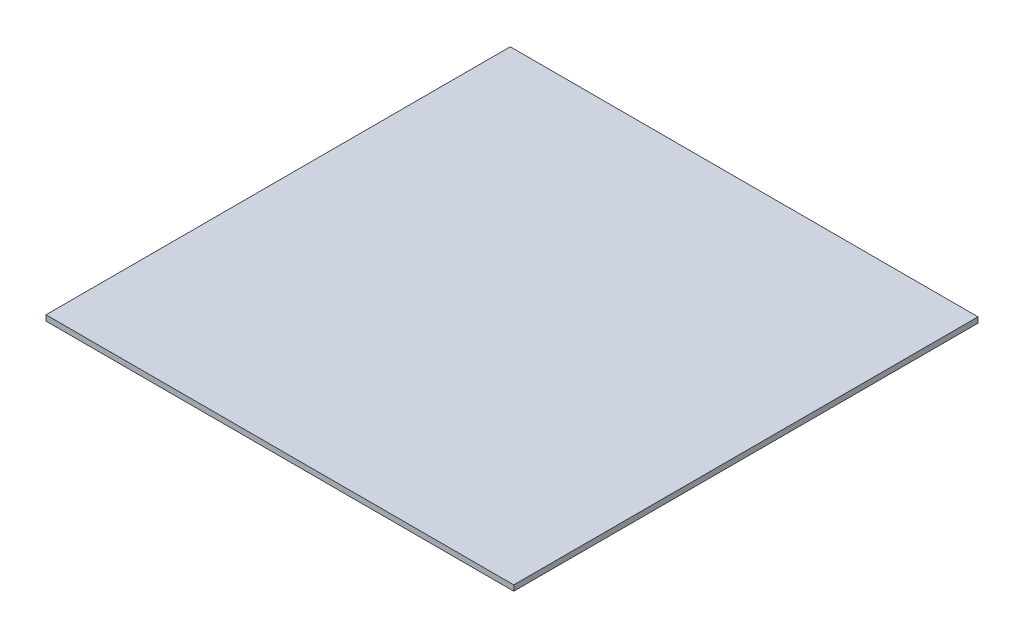
ISO-10303-21;
HEADER;
FILE_DESCRIPTION(('STEP AP214'),'2;1');
FILE_NAME('part.step','',(''),(''),'','','');
FILE_SCHEMA(('AUTOMOTIVE_DESIGN { 1 0 10303 214 1 1 1 1 }'));
ENDSEC;
DATA;
#1=APPLICATION_CONTEXT('core data for automotive mechanical design processes');
#2=APPLICATION_PROTOCOL_DEFINITION('international standard','automotive_design',2000,#1);
#3=PRODUCT_CONTEXT('',#1,'mechanical');
#4=PRODUCT('Part','Part','',(#3));
#5=PRODUCT_RELATED_PRODUCT_CATEGORY('part','',(#4));
#6=PRODUCT_DEFINITION_FORMATION('','',#4);
#7=PRODUCT_DEFINITION_CONTEXT('part definition',#1,'design');
#8=PRODUCT_DEFINITION('design','',#6,#7);
#9=PRODUCT_DEFINITION_SHAPE('','',#8);
#10=(LENGTH_UNIT() NAMED_UNIT(*) SI_UNIT(.MILLI.,.METRE.));
#11=(NAMED_UNIT(*) PLANE_ANGLE_UNIT() SI_UNIT($,.RADIAN.));
#12=(NAMED_UNIT(*) SI_UNIT($,.STERADIAN.) SOLID_ANGLE_UNIT());
#13=UNCERTAINTY_MEASURE_WITH_UNIT(LENGTH_MEASURE(1.E-05),#10,'distance_accuracy_value','');
#14=(GEOMETRIC_REPRESENTATION_CONTEXT(3) GLOBAL_UNCERTAINTY_ASSIGNED_CONTEXT((#13)) GLOBAL_UNIT_ASSIGNED_CONTEXT((#10,
#11,#12)) REPRESENTATION_CONTEXT('',''));
#15=CARTESIAN_POINT('',(0.,0.,0.));
#16=DIRECTION('',(0.,0.,1.));
#17=DIRECTION('',(1.,0.,0.));
#18=AXIS2_PLACEMENT_3D('',#15,#16,#17);
#19=CARTESIAN_POINT('',(0.,1.5875,0.));
#20=DIRECTION('',(1.,0.,0.));
#21=DIRECTION('',(0.,0.,-1.));
#22=AXIS2_PLACEMENT_3D('',#19,#20,#21);
#23=PLANE('',#22);
#24=DIRECTION('',(0.,0.,1.));
#25=VECTOR('',#24,1.);
#26=CARTESIAN_POINT('',(0.,0.,0.));
#27=LINE('',#26,#25);
#28=CARTESIAN_POINT('',(0.,0.,-133.35));
#29=VERTEX_POINT('',#28);
#30=CARTESIAN_POINT('',(0.,0.,0.));
#31=VERTEX_POINT('',#30);
#32=EDGE_CURVE('E96',#29,#31,#27,.T.);
#33=ORIENTED_EDGE('',*,*,#32,.T.);
#34=DIRECTION('',(0.,-1.,0.));
#35=VECTOR('',#34,1.);
#36=CARTESIAN_POINT('',(0.,1.5875,0.));
#37=LINE('',#36,#35);
#38=CARTESIAN_POINT('',(0.,1.5875,0.));
#39=VERTEX_POINT('',#38);
#40=EDGE_CURVE('E11',#39,#31,#37,.T.);
#41=ORIENTED_EDGE('',*,*,#40,.F.);
#42=DIRECTION('',(0.,0.,1.));
#43=VECTOR('',#42,1.);
#44=CARTESIAN_POINT('',(0.,1.5875,0.));
#45=LINE('',#44,#43);
#46=CARTESIAN_POINT('',(0.,1.5875,-133.35));
#47=VERTEX_POINT('',#46);
#48=EDGE_CURVE('E84',#47,#39,#45,.T.);
#49=ORIENTED_EDGE('',*,*,#48,.F.);
#50=DIRECTION('',(0.,-1.,0.));
#51=VECTOR('',#50,1.);
#52=CARTESIAN_POINT('',(0.,1.5875,-133.35));
#53=LINE('',#52,#51);
#54=EDGE_CURVE('E92',#47,#29,#53,.T.);
#55=ORIENTED_EDGE('',*,*,#54,.T.);
#56=EDGE_LOOP('',(#33,#41,#49,#55));
#57=FACE_BOUND('',#56,.T.);
#58=ADVANCED_FACE('F33',(#57),#23,.F.);
#59=CARTESIAN_POINT('',(0.,1.5875,0.));
#60=DIRECTION('',(0.,0.,-1.));
#61=DIRECTION('',(-1.,0.,0.));
#62=AXIS2_PLACEMENT_3D('',#59,#60,#61);
#63=PLANE('',#62);
#64=DIRECTION('',(1.,0.,0.));
#65=VECTOR('',#64,1.);
#66=CARTESIAN_POINT('',(0.,0.,0.));
#67=LINE('',#66,#65);
#68=CARTESIAN_POINT('',(134.366,0.,0.));
#69=VERTEX_POINT('',#68);
#70=EDGE_CURVE('E88',#31,#69,#67,.T.);
#71=ORIENTED_EDGE('',*,*,#70,.T.);
#72=DIRECTION('',(0.,-1.,0.));
#73=VECTOR('',#72,1.);
#74=CARTESIAN_POINT('',(134.366,1.5875,0.));
#75=LINE('',#74,#73);
#76=CARTESIAN_POINT('',(134.366,1.5875,0.));
#77=VERTEX_POINT('',#76);
#78=EDGE_CURVE('E41',#77,#69,#75,.T.);
#79=ORIENTED_EDGE('',*,*,#78,.F.);
#80=DIRECTION('',(1.,0.,0.));
#81=VECTOR('',#80,1.);
#82=CARTESIAN_POINT('',(0.,1.5875,0.));
#83=LINE('',#82,#81);
#84=EDGE_CURVE('E79',#39,#77,#83,.T.);
#85=ORIENTED_EDGE('',*,*,#84,.F.);
#86=ORIENTED_EDGE('',*,*,#40,.T.);
#87=EDGE_LOOP('',(#71,#79,#85,#86));
#88=FACE_BOUND('',#87,.T.);
#89=ADVANCED_FACE('F87',(#88),#63,.F.);
#90=CARTESIAN_POINT('',(134.366,1.5875,0.));
#91=DIRECTION('',(-1.,0.,0.));
#92=DIRECTION('',(0.,0.,1.));
#93=AXIS2_PLACEMENT_3D('',#90,#91,#92);
#94=PLANE('',#93);
#95=DIRECTION('',(0.,0.,-1.));
#96=VECTOR('',#95,1.);
#97=CARTESIAN_POINT('',(134.366,0.,0.));
#98=LINE('',#97,#96);
#99=CARTESIAN_POINT('',(134.366,0.,-133.35));
#100=VERTEX_POINT('',#99);
#101=EDGE_CURVE('E66',#69,#100,#98,.T.);
#102=ORIENTED_EDGE('',*,*,#101,.T.);
#103=DIRECTION('',(0.,-1.,0.));
#104=VECTOR('',#103,1.);
#105=CARTESIAN_POINT('',(134.366,1.5875,-133.35));
#106=LINE('',#105,#104);
#107=CARTESIAN_POINT('',(134.366,1.5875,-133.35));
#108=VERTEX_POINT('',#107);
#109=EDGE_CURVE('E89',#108,#100,#106,.T.);
#110=ORIENTED_EDGE('',*,*,#109,.F.);
#111=DIRECTION('',(0.,0.,-1.));
#112=VECTOR('',#111,1.);
#113=CARTESIAN_POINT('',(134.366,1.5875,0.));
#114=LINE('',#113,#112);
#115=EDGE_CURVE('E82',#77,#108,#114,.T.);
#116=ORIENTED_EDGE('',*,*,#115,.F.);
#117=ORIENTED_EDGE('',*,*,#78,.T.);
#118=EDGE_LOOP('',(#102,#110,#116,#117));
#119=FACE_BOUND('',#118,.T.);
#120=ADVANCED_FACE('F90',(#119),#94,.F.);
#121=CARTESIAN_POINT('',(0.,1.5875,-133.35));
#122=DIRECTION('',(0.,0.,1.));
#123=DIRECTION('',(1.,0.,0.));
#124=AXIS2_PLACEMENT_3D('',#121,#122,#123);
#125=PLANE('',#124);
#126=DIRECTION('',(-1.,0.,0.));
#127=VECTOR('',#126,1.);
#128=CARTESIAN_POINT('',(0.,0.,-133.35));
#129=LINE('',#128,#127);
#130=EDGE_CURVE('E72',#100,#29,#129,.T.);
#131=ORIENTED_EDGE('',*,*,#130,.T.);
#132=ORIENTED_EDGE('',*,*,#54,.F.);
#133=DIRECTION('',(-1.,0.,0.));
#134=VECTOR('',#133,1.);
#135=CARTESIAN_POINT('',(0.,1.5875,-133.35));
#136=LINE('',#135,#134);
#137=EDGE_CURVE('E49',#108,#47,#136,.T.);
#138=ORIENTED_EDGE('',*,*,#137,.F.);
#139=ORIENTED_EDGE('',*,*,#109,.T.);
#140=EDGE_LOOP('',(#131,#132,#138,#139));
#141=FACE_BOUND('',#140,.T.);
#142=ADVANCED_FACE('F103',(#141),#125,.F.);
#143=CARTESIAN_POINT('',(0.,1.5875,0.));
#144=DIRECTION('',(0.,-1.,0.));
#145=DIRECTION('',(0.,0.,-1.));
#146=AXIS2_PLACEMENT_3D('',#143,#144,#145);
#147=PLANE('',#146);
#148=ORIENTED_EDGE('',*,*,#48,.T.);
#149=ORIENTED_EDGE('',*,*,#84,.T.);
#150=ORIENTED_EDGE('',*,*,#115,.T.);
#151=ORIENTED_EDGE('',*,*,#137,.T.);
#152=EDGE_LOOP('',(#148,#149,#150,#151));
#153=FACE_BOUND('',#152,.T.);
#154=ADVANCED_FACE('F80',(#153),#147,.F.);
#155=CARTESIAN_POINT('',(0.,0.,0.));
#156=DIRECTION('',(0.,-1.,0.));
#157=DIRECTION('',(0.,0.,-1.));
#158=AXIS2_PLACEMENT_3D('',#155,#156,#157);
#159=PLANE('',#158);
#160=ORIENTED_EDGE('',*,*,#32,.F.);
#161=ORIENTED_EDGE('',*,*,#130,.F.);
#162=ORIENTED_EDGE('',*,*,#101,.F.);
#163=ORIENTED_EDGE('',*,*,#70,.F.);
#164=EDGE_LOOP('',(#160,#161,#162,#163));
#165=FACE_BOUND('',#164,.T.);
#166=ADVANCED_FACE('F106',(#165),#159,.T.);
#167=CLOSED_SHELL('',(#58,#89,#120,#142,#154,#166));
#168=MANIFOLD_SOLID_BREP('B2',#167);
#169=ADVANCED_BREP_SHAPE_REPRESENTATION('',(#18,#168),#14);
#170=SHAPE_DEFINITION_REPRESENTATION(#9,#169);
ENDSEC;
END-ISO-10303-21;
